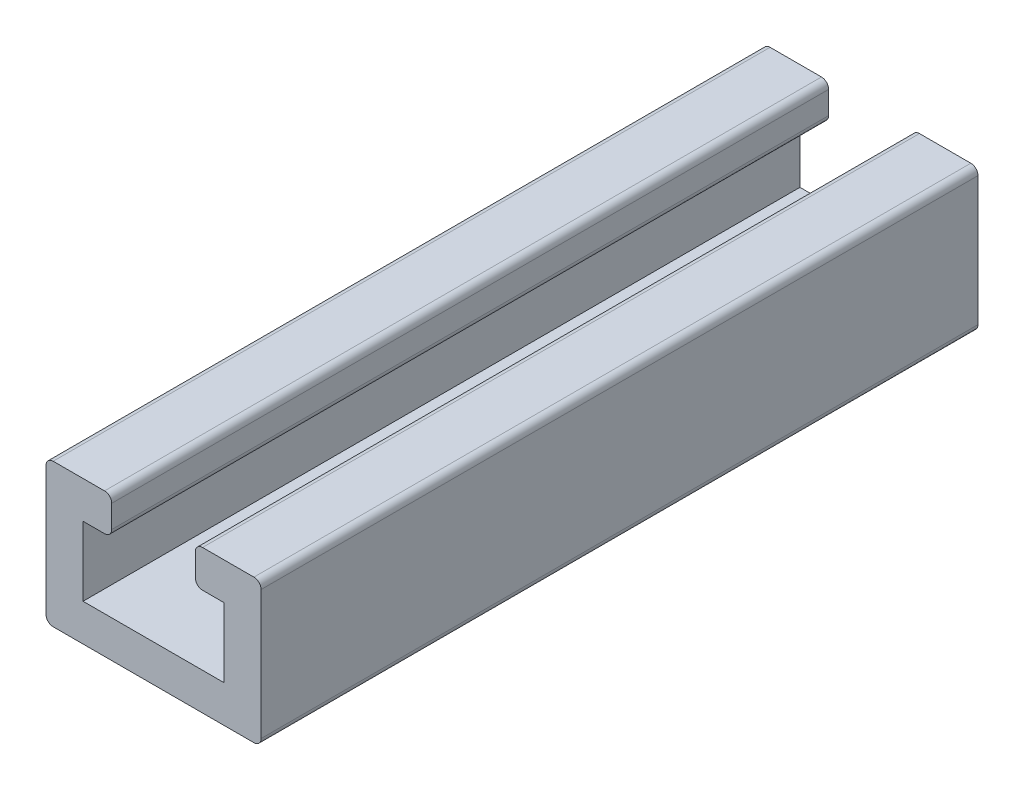
ISO-10303-21;
HEADER;
FILE_DESCRIPTION(('STEP AP214'),'2;1');
FILE_NAME('part.step','',(''),(''),'','','');
FILE_SCHEMA(('AUTOMOTIVE_DESIGN { 1 0 10303 214 1 1 1 1 }'));
ENDSEC;
DATA;
#1=APPLICATION_CONTEXT('core data for automotive mechanical design processes');
#2=APPLICATION_PROTOCOL_DEFINITION('international standard','automotive_design',2000,#1);
#3=PRODUCT_CONTEXT('',#1,'mechanical');
#4=PRODUCT('Part','Part','',(#3));
#5=PRODUCT_RELATED_PRODUCT_CATEGORY('part','',(#4));
#6=PRODUCT_DEFINITION_FORMATION('','',#4);
#7=PRODUCT_DEFINITION_CONTEXT('part definition',#1,'design');
#8=PRODUCT_DEFINITION('design','',#6,#7);
#9=PRODUCT_DEFINITION_SHAPE('','',#8);
#10=(LENGTH_UNIT() NAMED_UNIT(*) SI_UNIT(.MILLI.,.METRE.));
#11=(NAMED_UNIT(*) PLANE_ANGLE_UNIT() SI_UNIT($,.RADIAN.));
#12=(NAMED_UNIT(*) SI_UNIT($,.STERADIAN.) SOLID_ANGLE_UNIT());
#13=UNCERTAINTY_MEASURE_WITH_UNIT(LENGTH_MEASURE(1.E-05),#10,'distance_accuracy_value','');
#14=(GEOMETRIC_REPRESENTATION_CONTEXT(3) GLOBAL_UNCERTAINTY_ASSIGNED_CONTEXT((#13)) GLOBAL_UNIT_ASSIGNED_CONTEXT((#10,
#11,#12)) REPRESENTATION_CONTEXT('',''));
#15=CARTESIAN_POINT('',(0.,0.,0.));
#16=DIRECTION('',(0.,0.,1.));
#17=DIRECTION('',(1.,0.,0.));
#18=AXIS2_PLACEMENT_3D('',#15,#16,#17);
#19=CARTESIAN_POINT('',(-20.0271048862009,7.98576051779936,30.));
#20=DIRECTION('',(0.,0.,-1.));
#21=DIRECTION('',(-1.,0.,0.));
#22=AXIS2_PLACEMENT_3D('',#19,#20,#21);
#23=CYLINDRICAL_SURFACE('',#22,0.300000000000001);
#24=CARTESIAN_POINT('',(-20.0271048862009,7.98576051779936,0.));
#25=DIRECTION('',(0.,0.,1.));
#26=DIRECTION('',(1.,0.,0.));
#27=AXIS2_PLACEMENT_3D('',#24,#25,#26);
#28=CIRCLE('',#27,0.300000000000001);
#29=CARTESIAN_POINT('',(-20.0271048862009,7.68576051779936,0.));
#30=VERTEX_POINT('',#29);
#31=CARTESIAN_POINT('',(-19.7271048862009,7.98576051779936,0.));
#32=VERTEX_POINT('',#31);
#33=EDGE_CURVE('E204',#30,#32,#28,.T.);
#34=ORIENTED_EDGE('',*,*,#33,.T.);
#35=DIRECTION('',(0.,0.,-1.));
#36=VECTOR('',#35,1.);
#37=CARTESIAN_POINT('',(-19.7271048862009,7.98576051779936,30.));
#38=LINE('',#37,#36);
#39=CARTESIAN_POINT('',(-19.7271048862009,7.98576051779936,30.));
#40=VERTEX_POINT('',#39);
#41=EDGE_CURVE('E11',#40,#32,#38,.T.);
#42=ORIENTED_EDGE('',*,*,#41,.F.);
#43=CARTESIAN_POINT('',(-20.0271048862009,7.98576051779936,30.));
#44=DIRECTION('',(0.,0.,1.));
#45=DIRECTION('',(1.,0.,0.));
#46=AXIS2_PLACEMENT_3D('',#43,#44,#45);
#47=CIRCLE('',#46,0.300000000000001);
#48=CARTESIAN_POINT('',(-20.0271048862009,7.68576051779936,30.));
#49=VERTEX_POINT('',#48);
#50=EDGE_CURVE('E242',#49,#40,#47,.T.);
#51=ORIENTED_EDGE('',*,*,#50,.F.);
#52=DIRECTION('',(0.,0.,-1.));
#53=VECTOR('',#52,1.);
#54=CARTESIAN_POINT('',(-20.0271048862009,7.68576051779936,30.));
#55=LINE('',#54,#53);
#56=EDGE_CURVE('E200',#49,#30,#55,.T.);
#57=ORIENTED_EDGE('',*,*,#56,.T.);
#58=EDGE_LOOP('',(#34,#42,#51,#57));
#59=FACE_BOUND('',#58,.T.);
#60=ADVANCED_FACE('F36',(#59),#23,.T.);
#61=CARTESIAN_POINT('',(-19.7271048862009,7.98576051779936,30.));
#62=DIRECTION('',(-1.,0.,0.));
#63=DIRECTION('',(0.,0.,1.));
#64=AXIS2_PLACEMENT_3D('',#61,#62,#63);
#65=PLANE('',#64);
#66=DIRECTION('',(0.,1.,0.));
#67=VECTOR('',#66,1.);
#68=CARTESIAN_POINT('',(-19.7271048862009,7.98576051779936,0.));
#69=LINE('',#68,#67);
#70=CARTESIAN_POINT('',(-19.7271048862009,13.3857605177994,0.));
#71=VERTEX_POINT('',#70);
#72=EDGE_CURVE('E207',#32,#71,#69,.T.);
#73=ORIENTED_EDGE('',*,*,#72,.T.);
#74=DIRECTION('',(0.,0.,-1.));
#75=VECTOR('',#74,1.);
#76=CARTESIAN_POINT('',(-19.7271048862009,13.3857605177994,30.));
#77=LINE('',#76,#75);
#78=CARTESIAN_POINT('',(-19.7271048862009,13.3857605177994,30.));
#79=VERTEX_POINT('',#78);
#80=EDGE_CURVE('E44',#79,#71,#77,.T.);
#81=ORIENTED_EDGE('',*,*,#80,.F.);
#82=DIRECTION('',(0.,1.,0.));
#83=VECTOR('',#82,1.);
#84=CARTESIAN_POINT('',(-19.7271048862009,7.98576051779936,30.));
#85=LINE('',#84,#83);
#86=EDGE_CURVE('E131',#40,#79,#85,.T.);
#87=ORIENTED_EDGE('',*,*,#86,.F.);
#88=ORIENTED_EDGE('',*,*,#41,.T.);
#89=EDGE_LOOP('',(#73,#81,#87,#88));
#90=FACE_BOUND('',#89,.T.);
#91=ADVANCED_FACE('F360',(#90),#65,.F.);
#92=CARTESIAN_POINT('',(-20.0271048862009,13.3857605177994,30.));
#93=DIRECTION('',(0.,0.,-1.));
#94=DIRECTION('',(-1.,0.,0.));
#95=AXIS2_PLACEMENT_3D('',#92,#93,#94);
#96=CYLINDRICAL_SURFACE('',#95,0.300000000000001);
#97=CARTESIAN_POINT('',(-20.0271048862009,13.3857605177994,0.));
#98=DIRECTION('',(0.,0.,1.));
#99=DIRECTION('',(1.,0.,0.));
#100=AXIS2_PLACEMENT_3D('',#97,#98,#99);
#101=CIRCLE('',#100,0.300000000000001);
#102=CARTESIAN_POINT('',(-20.0271048862009,13.6857605177994,0.));
#103=VERTEX_POINT('',#102);
#104=EDGE_CURVE('E209',#71,#103,#101,.T.);
#105=ORIENTED_EDGE('',*,*,#104,.T.);
#106=DIRECTION('',(0.,0.,-1.));
#107=VECTOR('',#106,1.);
#108=CARTESIAN_POINT('',(-20.0271048862009,13.6857605177994,30.));
#109=LINE('',#108,#107);
#110=CARTESIAN_POINT('',(-20.0271048862009,13.6857605177994,30.));
#111=VERTEX_POINT('',#110);
#112=EDGE_CURVE('E285',#111,#103,#109,.T.);
#113=ORIENTED_EDGE('',*,*,#112,.F.);
#114=CARTESIAN_POINT('',(-20.0271048862009,13.3857605177994,30.));
#115=DIRECTION('',(0.,0.,1.));
#116=DIRECTION('',(1.,0.,0.));
#117=AXIS2_PLACEMENT_3D('',#114,#115,#116);
#118=CIRCLE('',#117,0.300000000000001);
#119=EDGE_CURVE('E293',#79,#111,#118,.T.);
#120=ORIENTED_EDGE('',*,*,#119,.F.);
#121=ORIENTED_EDGE('',*,*,#80,.T.);
#122=EDGE_LOOP('',(#105,#113,#120,#121));
#123=FACE_BOUND('',#122,.T.);
#124=ADVANCED_FACE('F291',(#123),#96,.T.);
#125=CARTESIAN_POINT('',(-20.0271048862009,13.6857605177994,30.));
#126=DIRECTION('',(0.,-1.,0.));
#127=DIRECTION('',(0.,0.,-1.));
#128=AXIS2_PLACEMENT_3D('',#125,#126,#127);
#129=PLANE('',#128);
#130=DIRECTION('',(-1.,0.,0.));
#131=VECTOR('',#130,1.);
#132=CARTESIAN_POINT('',(-20.0271048862009,13.6857605177994,0.));
#133=LINE('',#132,#131);
#134=CARTESIAN_POINT('',(-22.1771048862009,13.6857605177994,0.));
#135=VERTEX_POINT('',#134);
#136=EDGE_CURVE('E211',#103,#135,#133,.T.);
#137=ORIENTED_EDGE('',*,*,#136,.T.);
#138=DIRECTION('',(0.,0.,-1.));
#139=VECTOR('',#138,1.);
#140=CARTESIAN_POINT('',(-22.1771048862009,13.6857605177994,30.));
#141=LINE('',#140,#139);
#142=CARTESIAN_POINT('',(-22.1771048862009,13.6857605177994,30.));
#143=VERTEX_POINT('',#142);
#144=EDGE_CURVE('E282',#143,#135,#141,.T.);
#145=ORIENTED_EDGE('',*,*,#144,.F.);
#146=DIRECTION('',(-1.,0.,0.));
#147=VECTOR('',#146,1.);
#148=CARTESIAN_POINT('',(-20.0271048862009,13.6857605177994,30.));
#149=LINE('',#148,#147);
#150=EDGE_CURVE('E311',#111,#143,#149,.T.);
#151=ORIENTED_EDGE('',*,*,#150,.F.);
#152=ORIENTED_EDGE('',*,*,#112,.T.);
#153=EDGE_LOOP('',(#137,#145,#151,#152));
#154=FACE_BOUND('',#153,.T.);
#155=ADVANCED_FACE('F302',(#154),#129,.F.);
#156=CARTESIAN_POINT('',(-22.1771048862009,13.3857605177994,30.));
#157=DIRECTION('',(0.,0.,-1.));
#158=DIRECTION('',(-1.,0.,0.));
#159=AXIS2_PLACEMENT_3D('',#156,#157,#158);
#160=CYLINDRICAL_SURFACE('',#159,0.300000000000001);
#161=CARTESIAN_POINT('',(-22.1771048862009,13.3857605177994,0.));
#162=DIRECTION('',(0.,0.,1.));
#163=DIRECTION('',(1.,0.,0.));
#164=AXIS2_PLACEMENT_3D('',#161,#162,#163);
#165=CIRCLE('',#164,0.300000000000001);
#166=CARTESIAN_POINT('',(-22.4771048862009,13.3857605177994,0.));
#167=VERTEX_POINT('',#166);
#168=EDGE_CURVE('E213',#135,#167,#165,.T.);
#169=ORIENTED_EDGE('',*,*,#168,.T.);
#170=DIRECTION('',(0.,0.,-1.));
#171=VECTOR('',#170,1.);
#172=CARTESIAN_POINT('',(-22.4771048862009,13.3857605177994,30.));
#173=LINE('',#172,#171);
#174=CARTESIAN_POINT('',(-22.4771048862009,13.3857605177994,30.));
#175=VERTEX_POINT('',#174);
#176=EDGE_CURVE('E279',#175,#167,#173,.T.);
#177=ORIENTED_EDGE('',*,*,#176,.F.);
#178=CARTESIAN_POINT('',(-22.1771048862009,13.3857605177994,30.));
#179=DIRECTION('',(0.,0.,1.));
#180=DIRECTION('',(1.,0.,0.));
#181=AXIS2_PLACEMENT_3D('',#178,#179,#180);
#182=CIRCLE('',#181,0.300000000000001);
#183=EDGE_CURVE('E308',#143,#175,#182,.T.);
#184=ORIENTED_EDGE('',*,*,#183,.F.);
#185=ORIENTED_EDGE('',*,*,#144,.T.);
#186=EDGE_LOOP('',(#169,#177,#184,#185));
#187=FACE_BOUND('',#186,.T.);
#188=ADVANCED_FACE('F306',(#187),#160,.T.);
#189=CARTESIAN_POINT('',(-22.4771048862009,13.3857605177994,30.));
#190=DIRECTION('',(1.,0.,0.));
#191=DIRECTION('',(0.,0.,-1.));
#192=AXIS2_PLACEMENT_3D('',#189,#190,#191);
#193=PLANE('',#192);
#194=DIRECTION('',(0.,-1.,0.));
#195=VECTOR('',#194,1.);
#196=CARTESIAN_POINT('',(-22.4771048862009,13.3857605177994,0.));
#197=LINE('',#196,#195);
#198=CARTESIAN_POINT('',(-22.4771048862009,12.4357605177994,0.));
#199=VERTEX_POINT('',#198);
#200=EDGE_CURVE('E215',#167,#199,#197,.T.);
#201=ORIENTED_EDGE('',*,*,#200,.T.);
#202=DIRECTION('',(0.,0.,-1.));
#203=VECTOR('',#202,1.);
#204=CARTESIAN_POINT('',(-22.4771048862009,12.4357605177994,30.));
#205=LINE('',#204,#203);
#206=CARTESIAN_POINT('',(-22.4771048862009,12.4357605177994,30.));
#207=VERTEX_POINT('',#206);
#208=EDGE_CURVE('E276',#207,#199,#205,.T.);
#209=ORIENTED_EDGE('',*,*,#208,.F.);
#210=DIRECTION('',(0.,-1.,0.));
#211=VECTOR('',#210,1.);
#212=CARTESIAN_POINT('',(-22.4771048862009,13.3857605177994,30.));
#213=LINE('',#212,#211);
#214=EDGE_CURVE('E310',#175,#207,#213,.T.);
#215=ORIENTED_EDGE('',*,*,#214,.F.);
#216=ORIENTED_EDGE('',*,*,#176,.T.);
#217=EDGE_LOOP('',(#201,#209,#215,#216));
#218=FACE_BOUND('',#217,.T.);
#219=ADVANCED_FACE('F373',(#218),#193,.F.);
#220=CARTESIAN_POINT('',(-22.1771048862009,12.4357605177994,30.));
#221=DIRECTION('',(0.,0.,-1.));
#222=DIRECTION('',(-1.,0.,0.));
#223=AXIS2_PLACEMENT_3D('',#220,#221,#222);
#224=CYLINDRICAL_SURFACE('',#223,0.300000000000001);
#225=CARTESIAN_POINT('',(-22.1771048862009,12.4357605177994,0.));
#226=DIRECTION('',(0.,0.,1.));
#227=DIRECTION('',(-1.,0.,0.));
#228=AXIS2_PLACEMENT_3D('',#225,#226,#227);
#229=CIRCLE('',#228,0.300000000000001);
#230=CARTESIAN_POINT('',(-22.1771048862009,12.1357605177994,0.));
#231=VERTEX_POINT('',#230);
#232=EDGE_CURVE('E217',#199,#231,#229,.T.);
#233=ORIENTED_EDGE('',*,*,#232,.T.);
#234=DIRECTION('',(0.,0.,-1.));
#235=VECTOR('',#234,1.);
#236=CARTESIAN_POINT('',(-22.1771048862009,12.1357605177994,30.));
#237=LINE('',#236,#235);
#238=CARTESIAN_POINT('',(-22.1771048862009,12.1357605177994,30.));
#239=VERTEX_POINT('',#238);
#240=EDGE_CURVE('E273',#239,#231,#237,.T.);
#241=ORIENTED_EDGE('',*,*,#240,.F.);
#242=CARTESIAN_POINT('',(-22.1771048862009,12.4357605177994,30.));
#243=DIRECTION('',(0.,0.,1.));
#244=DIRECTION('',(-1.,0.,0.));
#245=AXIS2_PLACEMENT_3D('',#242,#243,#244);
#246=CIRCLE('',#245,0.300000000000001);
#247=EDGE_CURVE('E313',#207,#239,#246,.T.);
#248=ORIENTED_EDGE('',*,*,#247,.F.);
#249=ORIENTED_EDGE('',*,*,#208,.T.);
#250=EDGE_LOOP('',(#233,#241,#248,#249));
#251=FACE_BOUND('',#250,.T.);
#252=ADVANCED_FACE('F376',(#251),#224,.T.);
#253=CARTESIAN_POINT('',(-22.1771048862009,12.1357605177994,30.));
#254=DIRECTION('',(0.,1.,0.));
#255=DIRECTION('',(0.,0.,1.));
#256=AXIS2_PLACEMENT_3D('',#253,#254,#255);
#257=PLANE('',#256);
#258=DIRECTION('',(1.,0.,0.));
#259=VECTOR('',#258,1.);
#260=CARTESIAN_POINT('',(-22.1771048862009,12.1357605177994,0.));
#261=LINE('',#260,#259);
#262=CARTESIAN_POINT('',(-21.2771048862009,12.1357605177994,0.));
#263=VERTEX_POINT('',#262);
#264=EDGE_CURVE('E219',#231,#263,#261,.T.);
#265=ORIENTED_EDGE('',*,*,#264,.T.);
#266=DIRECTION('',(0.,0.,-1.));
#267=VECTOR('',#266,1.);
#268=CARTESIAN_POINT('',(-21.2771048862009,12.1357605177994,30.));
#269=LINE('',#268,#267);
#270=CARTESIAN_POINT('',(-21.2771048862009,12.1357605177994,30.));
#271=VERTEX_POINT('',#270);
#272=EDGE_CURVE('E270',#271,#263,#269,.T.);
#273=ORIENTED_EDGE('',*,*,#272,.F.);
#274=DIRECTION('',(1.,0.,0.));
#275=VECTOR('',#274,1.);
#276=CARTESIAN_POINT('',(-22.1771048862009,12.1357605177994,30.));
#277=LINE('',#276,#275);
#278=EDGE_CURVE('E319',#239,#271,#277,.T.);
#279=ORIENTED_EDGE('',*,*,#278,.F.);
#280=ORIENTED_EDGE('',*,*,#240,.T.);
#281=EDGE_LOOP('',(#265,#273,#279,#280));
#282=FACE_BOUND('',#281,.T.);
#283=ADVANCED_FACE('F380',(#282),#257,.F.);
#284=CARTESIAN_POINT('',(-21.2771048862009,12.1357605177994,30.));
#285=DIRECTION('',(1.,0.,0.));
#286=DIRECTION('',(0.,0.,-1.));
#287=AXIS2_PLACEMENT_3D('',#284,#285,#286);
#288=PLANE('',#287);
#289=DIRECTION('',(0.,-1.,0.));
#290=VECTOR('',#289,1.);
#291=CARTESIAN_POINT('',(-21.2771048862009,12.1357605177994,0.));
#292=LINE('',#291,#290);
#293=CARTESIAN_POINT('',(-21.2771048862009,9.23576051779936,0.));
#294=VERTEX_POINT('',#293);
#295=EDGE_CURVE('E221',#263,#294,#292,.T.);
#296=ORIENTED_EDGE('',*,*,#295,.T.);
#297=DIRECTION('',(0.,0.,-1.));
#298=VECTOR('',#297,1.);
#299=CARTESIAN_POINT('',(-21.2771048862009,9.23576051779936,30.));
#300=LINE('',#299,#298);
#301=CARTESIAN_POINT('',(-21.2771048862009,9.23576051779936,30.));
#302=VERTEX_POINT('',#301);
#303=EDGE_CURVE('E267',#302,#294,#300,.T.);
#304=ORIENTED_EDGE('',*,*,#303,.F.);
#305=DIRECTION('',(0.,-1.,0.));
#306=VECTOR('',#305,1.);
#307=CARTESIAN_POINT('',(-21.2771048862009,12.1357605177994,30.));
#308=LINE('',#307,#306);
#309=EDGE_CURVE('E321',#271,#302,#308,.T.);
#310=ORIENTED_EDGE('',*,*,#309,.F.);
#311=ORIENTED_EDGE('',*,*,#272,.T.);
#312=EDGE_LOOP('',(#296,#304,#310,#311));
#313=FACE_BOUND('',#312,.T.);
#314=ADVANCED_FACE('F384',(#313),#288,.F.);
#315=CARTESIAN_POINT('',(-21.2771048862009,9.23576051779936,30.));
#316=DIRECTION('',(0.,-1.,0.));
#317=DIRECTION('',(1.,0.,0.));
#318=AXIS2_PLACEMENT_3D('',#315,#316,#317);
#319=PLANE('',#318);
#320=DIRECTION('',(-1.,0.,0.));
#321=VECTOR('',#320,1.);
#322=CARTESIAN_POINT('',(-21.2771048862009,9.23576051779936,0.));
#323=LINE('',#322,#321);
#324=CARTESIAN_POINT('',(-27.1771048862009,9.23576051779936,0.));
#325=VERTEX_POINT('',#324);
#326=EDGE_CURVE('E223',#294,#325,#323,.T.);
#327=ORIENTED_EDGE('',*,*,#326,.T.);
#328=DIRECTION('',(0.,0.,-1.));
#329=VECTOR('',#328,1.);
#330=CARTESIAN_POINT('',(-27.1771048862009,9.23576051779936,30.));
#331=LINE('',#330,#329);
#332=CARTESIAN_POINT('',(-27.1771048862009,9.23576051779936,30.));
#333=VERTEX_POINT('',#332);
#334=EDGE_CURVE('E264',#333,#325,#331,.T.);
#335=ORIENTED_EDGE('',*,*,#334,.F.);
#336=DIRECTION('',(-1.,0.,0.));
#337=VECTOR('',#336,1.);
#338=CARTESIAN_POINT('',(-21.2771048862009,9.23576051779936,30.));
#339=LINE('',#338,#337);
#340=EDGE_CURVE('E323',#302,#333,#339,.T.);
#341=ORIENTED_EDGE('',*,*,#340,.F.);
#342=ORIENTED_EDGE('',*,*,#303,.T.);
#343=EDGE_LOOP('',(#327,#335,#341,#342));
#344=FACE_BOUND('',#343,.T.);
#345=ADVANCED_FACE('F388',(#344),#319,.F.);
#346=CARTESIAN_POINT('',(-27.1771048862009,12.1357605177994,30.));
#347=DIRECTION('',(-1.,0.,0.));
#348=DIRECTION('',(0.,0.,1.));
#349=AXIS2_PLACEMENT_3D('',#346,#347,#348);
#350=PLANE('',#349);
#351=DIRECTION('',(0.,1.,0.));
#352=VECTOR('',#351,1.);
#353=CARTESIAN_POINT('',(-27.1771048862009,12.1357605177994,0.));
#354=LINE('',#353,#352);
#355=CARTESIAN_POINT('',(-27.1771048862009,12.1357605177994,0.));
#356=VERTEX_POINT('',#355);
#357=EDGE_CURVE('E225',#325,#356,#354,.T.);
#358=ORIENTED_EDGE('',*,*,#357,.T.);
#359=DIRECTION('',(0.,0.,-1.));
#360=VECTOR('',#359,1.);
#361=CARTESIAN_POINT('',(-27.1771048862009,12.1357605177994,30.));
#362=LINE('',#361,#360);
#363=CARTESIAN_POINT('',(-27.1771048862009,12.1357605177994,30.));
#364=VERTEX_POINT('',#363);
#365=EDGE_CURVE('E261',#364,#356,#362,.T.);
#366=ORIENTED_EDGE('',*,*,#365,.F.);
#367=DIRECTION('',(0.,1.,0.));
#368=VECTOR('',#367,1.);
#369=CARTESIAN_POINT('',(-27.1771048862009,12.1357605177994,30.));
#370=LINE('',#369,#368);
#371=EDGE_CURVE('E325',#333,#364,#370,.T.);
#372=ORIENTED_EDGE('',*,*,#371,.F.);
#373=ORIENTED_EDGE('',*,*,#334,.T.);
#374=EDGE_LOOP('',(#358,#366,#372,#373));
#375=FACE_BOUND('',#374,.T.);
#376=ADVANCED_FACE('F392',(#375),#350,.F.);
#377=CARTESIAN_POINT('',(-26.2771048862009,12.1357605177994,30.));
#378=DIRECTION('',(0.,1.,0.));
#379=DIRECTION('',(0.,0.,1.));
#380=AXIS2_PLACEMENT_3D('',#377,#378,#379);
#381=PLANE('',#380);
#382=DIRECTION('',(1.,0.,0.));
#383=VECTOR('',#382,1.);
#384=CARTESIAN_POINT('',(-26.2771048862009,12.1357605177994,0.));
#385=LINE('',#384,#383);
#386=CARTESIAN_POINT('',(-26.2771048862009,12.1357605177994,0.));
#387=VERTEX_POINT('',#386);
#388=EDGE_CURVE('E227',#356,#387,#385,.T.);
#389=ORIENTED_EDGE('',*,*,#388,.T.);
#390=DIRECTION('',(0.,0.,-1.));
#391=VECTOR('',#390,1.);
#392=CARTESIAN_POINT('',(-26.2771048862009,12.1357605177994,30.));
#393=LINE('',#392,#391);
#394=CARTESIAN_POINT('',(-26.2771048862009,12.1357605177994,30.));
#395=VERTEX_POINT('',#394);
#396=EDGE_CURVE('E258',#395,#387,#393,.T.);
#397=ORIENTED_EDGE('',*,*,#396,.F.);
#398=DIRECTION('',(1.,0.,0.));
#399=VECTOR('',#398,1.);
#400=CARTESIAN_POINT('',(-26.2771048862009,12.1357605177994,30.));
#401=LINE('',#400,#399);
#402=EDGE_CURVE('E327',#364,#395,#401,.T.);
#403=ORIENTED_EDGE('',*,*,#402,.F.);
#404=ORIENTED_EDGE('',*,*,#365,.T.);
#405=EDGE_LOOP('',(#389,#397,#403,#404));
#406=FACE_BOUND('',#405,.T.);
#407=ADVANCED_FACE('F396',(#406),#381,.F.);
#408=CARTESIAN_POINT('',(-26.2771048862009,12.4357605177994,30.));
#409=DIRECTION('',(0.,0.,-1.));
#410=DIRECTION('',(-1.,0.,0.));
#411=AXIS2_PLACEMENT_3D('',#408,#409,#410);
#412=CYLINDRICAL_SURFACE('',#411,0.300000000000001);
#413=CARTESIAN_POINT('',(-26.2771048862009,12.4357605177994,0.));
#414=DIRECTION('',(0.,0.,1.));
#415=DIRECTION('',(1.,0.,0.));
#416=AXIS2_PLACEMENT_3D('',#413,#414,#415);
#417=CIRCLE('',#416,0.300000000000001);
#418=CARTESIAN_POINT('',(-25.9771048862009,12.4357605177994,0.));
#419=VERTEX_POINT('',#418);
#420=EDGE_CURVE('E229',#387,#419,#417,.T.);
#421=ORIENTED_EDGE('',*,*,#420,.T.);
#422=DIRECTION('',(0.,0.,-1.));
#423=VECTOR('',#422,1.);
#424=CARTESIAN_POINT('',(-25.9771048862009,12.4357605177994,30.));
#425=LINE('',#424,#423);
#426=CARTESIAN_POINT('',(-25.9771048862009,12.4357605177994,30.));
#427=VERTEX_POINT('',#426);
#428=EDGE_CURVE('E255',#427,#419,#425,.T.);
#429=ORIENTED_EDGE('',*,*,#428,.F.);
#430=CARTESIAN_POINT('',(-26.2771048862009,12.4357605177994,30.));
#431=DIRECTION('',(0.,0.,1.));
#432=DIRECTION('',(1.,0.,0.));
#433=AXIS2_PLACEMENT_3D('',#430,#431,#432);
#434=CIRCLE('',#433,0.300000000000001);
#435=EDGE_CURVE('E329',#395,#427,#434,.T.);
#436=ORIENTED_EDGE('',*,*,#435,.F.);
#437=ORIENTED_EDGE('',*,*,#396,.T.);
#438=EDGE_LOOP('',(#421,#429,#436,#437));
#439=FACE_BOUND('',#438,.T.);
#440=ADVANCED_FACE('F400',(#439),#412,.T.);
#441=CARTESIAN_POINT('',(-25.9771048862009,13.3857605177994,30.));
#442=DIRECTION('',(-1.,0.,0.));
#443=DIRECTION('',(0.,0.,1.));
#444=AXIS2_PLACEMENT_3D('',#441,#442,#443);
#445=PLANE('',#444);
#446=DIRECTION('',(0.,1.,0.));
#447=VECTOR('',#446,1.);
#448=CARTESIAN_POINT('',(-25.9771048862009,13.3857605177994,0.));
#449=LINE('',#448,#447);
#450=CARTESIAN_POINT('',(-25.9771048862009,13.3857605177994,0.));
#451=VERTEX_POINT('',#450);
#452=EDGE_CURVE('E231',#419,#451,#449,.T.);
#453=ORIENTED_EDGE('',*,*,#452,.T.);
#454=DIRECTION('',(0.,0.,-1.));
#455=VECTOR('',#454,1.);
#456=CARTESIAN_POINT('',(-25.9771048862009,13.3857605177994,30.));
#457=LINE('',#456,#455);
#458=CARTESIAN_POINT('',(-25.9771048862009,13.3857605177994,30.));
#459=VERTEX_POINT('',#458);
#460=EDGE_CURVE('E252',#459,#451,#457,.T.);
#461=ORIENTED_EDGE('',*,*,#460,.F.);
#462=DIRECTION('',(0.,1.,0.));
#463=VECTOR('',#462,1.);
#464=CARTESIAN_POINT('',(-25.9771048862009,13.3857605177994,30.));
#465=LINE('',#464,#463);
#466=EDGE_CURVE('E331',#427,#459,#465,.T.);
#467=ORIENTED_EDGE('',*,*,#466,.F.);
#468=ORIENTED_EDGE('',*,*,#428,.T.);
#469=EDGE_LOOP('',(#453,#461,#467,#468));
#470=FACE_BOUND('',#469,.T.);
#471=ADVANCED_FACE('F404',(#470),#445,.F.);
#472=CARTESIAN_POINT('',(-26.2771048862009,13.3857605177994,30.));
#473=DIRECTION('',(0.,0.,-1.));
#474=DIRECTION('',(-1.,0.,0.));
#475=AXIS2_PLACEMENT_3D('',#472,#473,#474);
#476=CYLINDRICAL_SURFACE('',#475,0.300000000000001);
#477=CARTESIAN_POINT('',(-26.2771048862009,13.3857605177994,0.));
#478=DIRECTION('',(0.,0.,1.));
#479=DIRECTION('',(-1.,0.,0.));
#480=AXIS2_PLACEMENT_3D('',#477,#478,#479);
#481=CIRCLE('',#480,0.300000000000001);
#482=CARTESIAN_POINT('',(-26.2771048862009,13.6857605177994,0.));
#483=VERTEX_POINT('',#482);
#484=EDGE_CURVE('E233',#451,#483,#481,.T.);
#485=ORIENTED_EDGE('',*,*,#484,.T.);
#486=DIRECTION('',(0.,0.,-1.));
#487=VECTOR('',#486,1.);
#488=CARTESIAN_POINT('',(-26.2771048862009,13.6857605177994,30.));
#489=LINE('',#488,#487);
#490=CARTESIAN_POINT('',(-26.2771048862009,13.6857605177994,30.));
#491=VERTEX_POINT('',#490);
#492=EDGE_CURVE('E249',#491,#483,#489,.T.);
#493=ORIENTED_EDGE('',*,*,#492,.F.);
#494=CARTESIAN_POINT('',(-26.2771048862009,13.3857605177994,30.));
#495=DIRECTION('',(0.,0.,1.));
#496=DIRECTION('',(-1.,0.,0.));
#497=AXIS2_PLACEMENT_3D('',#494,#495,#496);
#498=CIRCLE('',#497,0.300000000000001);
#499=EDGE_CURVE('E333',#459,#491,#498,.T.);
#500=ORIENTED_EDGE('',*,*,#499,.F.);
#501=ORIENTED_EDGE('',*,*,#460,.T.);
#502=EDGE_LOOP('',(#485,#493,#500,#501));
#503=FACE_BOUND('',#502,.T.);
#504=ADVANCED_FACE('F408',(#503),#476,.T.);
#505=CARTESIAN_POINT('',(-28.4271048862009,13.6857605177994,30.));
#506=DIRECTION('',(0.,-1.,0.));
#507=DIRECTION('',(0.,0.,-1.));
#508=AXIS2_PLACEMENT_3D('',#505,#506,#507);
#509=PLANE('',#508);
#510=DIRECTION('',(-1.,0.,0.));
#511=VECTOR('',#510,1.);
#512=CARTESIAN_POINT('',(-28.4271048862009,13.6857605177994,0.));
#513=LINE('',#512,#511);
#514=CARTESIAN_POINT('',(-28.4271048862009,13.6857605177994,0.));
#515=VERTEX_POINT('',#514);
#516=EDGE_CURVE('E235',#483,#515,#513,.T.);
#517=ORIENTED_EDGE('',*,*,#516,.T.);
#518=DIRECTION('',(0.,0.,-1.));
#519=VECTOR('',#518,1.);
#520=CARTESIAN_POINT('',(-28.4271048862009,13.6857605177994,30.));
#521=LINE('',#520,#519);
#522=CARTESIAN_POINT('',(-28.4271048862009,13.6857605177994,30.));
#523=VERTEX_POINT('',#522);
#524=EDGE_CURVE('E246',#523,#515,#521,.T.);
#525=ORIENTED_EDGE('',*,*,#524,.F.);
#526=DIRECTION('',(-1.,0.,0.));
#527=VECTOR('',#526,1.);
#528=CARTESIAN_POINT('',(-28.4271048862009,13.6857605177994,30.));
#529=LINE('',#528,#527);
#530=EDGE_CURVE('E335',#491,#523,#529,.T.);
#531=ORIENTED_EDGE('',*,*,#530,.F.);
#532=ORIENTED_EDGE('',*,*,#492,.T.);
#533=EDGE_LOOP('',(#517,#525,#531,#532));
#534=FACE_BOUND('',#533,.T.);
#535=ADVANCED_FACE('F341',(#534),#509,.F.);
#536=CARTESIAN_POINT('',(-28.4271048862009,13.3857605177994,30.));
#537=DIRECTION('',(0.,0.,-1.));
#538=DIRECTION('',(-1.,0.,0.));
#539=AXIS2_PLACEMENT_3D('',#536,#537,#538);
#540=CYLINDRICAL_SURFACE('',#539,0.300000000000001);
#541=CARTESIAN_POINT('',(-28.4271048862009,13.3857605177994,0.));
#542=DIRECTION('',(0.,0.,1.));
#543=DIRECTION('',(-1.,0.,0.));
#544=AXIS2_PLACEMENT_3D('',#541,#542,#543);
#545=CIRCLE('',#544,0.300000000000001);
#546=CARTESIAN_POINT('',(-28.7271048862009,13.3857605177994,0.));
#547=VERTEX_POINT('',#546);
#548=EDGE_CURVE('E237',#515,#547,#545,.T.);
#549=ORIENTED_EDGE('',*,*,#548,.T.);
#550=DIRECTION('',(0.,0.,-1.));
#551=VECTOR('',#550,1.);
#552=CARTESIAN_POINT('',(-28.7271048862009,13.3857605177994,30.));
#553=LINE('',#552,#551);
#554=CARTESIAN_POINT('',(-28.7271048862009,13.3857605177994,30.));
#555=VERTEX_POINT('',#554);
#556=EDGE_CURVE('E195',#555,#547,#553,.T.);
#557=ORIENTED_EDGE('',*,*,#556,.F.);
#558=CARTESIAN_POINT('',(-28.4271048862009,13.3857605177994,30.));
#559=DIRECTION('',(0.,0.,1.));
#560=DIRECTION('',(-1.,0.,0.));
#561=AXIS2_PLACEMENT_3D('',#558,#559,#560);
#562=CIRCLE('',#561,0.300000000000001);
#563=EDGE_CURVE('E186',#523,#555,#562,.T.);
#564=ORIENTED_EDGE('',*,*,#563,.F.);
#565=ORIENTED_EDGE('',*,*,#524,.T.);
#566=EDGE_LOOP('',(#549,#557,#564,#565));
#567=FACE_BOUND('',#566,.T.);
#568=ADVANCED_FACE('F345',(#567),#540,.T.);
#569=CARTESIAN_POINT('',(-28.7271048862009,7.98576051779936,30.));
#570=DIRECTION('',(1.,0.,0.));
#571=DIRECTION('',(0.,0.,-1.));
#572=AXIS2_PLACEMENT_3D('',#569,#570,#571);
#573=PLANE('',#572);
#574=DIRECTION('',(0.,-1.,0.));
#575=VECTOR('',#574,1.);
#576=CARTESIAN_POINT('',(-28.7271048862009,7.98576051779936,0.));
#577=LINE('',#576,#575);
#578=CARTESIAN_POINT('',(-28.7271048862009,7.98576051779936,0.));
#579=VERTEX_POINT('',#578);
#580=EDGE_CURVE('E194',#547,#579,#577,.T.);
#581=ORIENTED_EDGE('',*,*,#580,.T.);
#582=DIRECTION('',(0.,0.,-1.));
#583=VECTOR('',#582,1.);
#584=CARTESIAN_POINT('',(-28.7271048862009,7.98576051779936,30.));
#585=LINE('',#584,#583);
#586=CARTESIAN_POINT('',(-28.7271048862009,7.98576051779936,30.));
#587=VERTEX_POINT('',#586);
#588=EDGE_CURVE('E191',#587,#579,#585,.T.);
#589=ORIENTED_EDGE('',*,*,#588,.F.);
#590=DIRECTION('',(0.,-1.,0.));
#591=VECTOR('',#590,1.);
#592=CARTESIAN_POINT('',(-28.7271048862009,7.98576051779936,30.));
#593=LINE('',#592,#591);
#594=EDGE_CURVE('E180',#555,#587,#593,.T.);
#595=ORIENTED_EDGE('',*,*,#594,.F.);
#596=ORIENTED_EDGE('',*,*,#556,.T.);
#597=EDGE_LOOP('',(#581,#589,#595,#596));
#598=FACE_BOUND('',#597,.T.);
#599=ADVANCED_FACE('F192',(#598),#573,.F.);
#600=CARTESIAN_POINT('',(-28.4271048862009,7.98576051779936,30.));
#601=DIRECTION('',(0.,0.,-1.));
#602=DIRECTION('',(-1.,0.,0.));
#603=AXIS2_PLACEMENT_3D('',#600,#601,#602);
#604=CYLINDRICAL_SURFACE('',#603,0.300000000000001);
#605=CARTESIAN_POINT('',(-28.4271048862009,7.98576051779936,0.));
#606=DIRECTION('',(0.,0.,1.));
#607=DIRECTION('',(-1.,0.,0.));
#608=AXIS2_PLACEMENT_3D('',#605,#606,#607);
#609=CIRCLE('',#608,0.300000000000001);
#610=CARTESIAN_POINT('',(-28.4271048862009,7.68576051779936,0.));
#611=VERTEX_POINT('',#610);
#612=EDGE_CURVE('E117',#579,#611,#609,.T.);
#613=ORIENTED_EDGE('',*,*,#612,.T.);
#614=DIRECTION('',(0.,0.,-1.));
#615=VECTOR('',#614,1.);
#616=CARTESIAN_POINT('',(-28.4271048862009,7.68576051779936,30.));
#617=LINE('',#616,#615);
#618=CARTESIAN_POINT('',(-28.4271048862009,7.68576051779936,30.));
#619=VERTEX_POINT('',#618);
#620=EDGE_CURVE('E196',#619,#611,#617,.T.);
#621=ORIENTED_EDGE('',*,*,#620,.F.);
#622=CARTESIAN_POINT('',(-28.4271048862009,7.98576051779936,30.));
#623=DIRECTION('',(0.,0.,1.));
#624=DIRECTION('',(-1.,0.,0.));
#625=AXIS2_PLACEMENT_3D('',#622,#623,#624);
#626=CIRCLE('',#625,0.300000000000001);
#627=EDGE_CURVE('E184',#587,#619,#626,.T.);
#628=ORIENTED_EDGE('',*,*,#627,.F.);
#629=ORIENTED_EDGE('',*,*,#588,.T.);
#630=EDGE_LOOP('',(#613,#621,#628,#629));
#631=FACE_BOUND('',#630,.T.);
#632=ADVANCED_FACE('F198',(#631),#604,.T.);
#633=CARTESIAN_POINT('',(-28.4271048862009,7.68576051779936,30.));
#634=DIRECTION('',(0.,1.,0.));
#635=DIRECTION('',(0.,0.,1.));
#636=AXIS2_PLACEMENT_3D('',#633,#634,#635);
#637=PLANE('',#636);
#638=DIRECTION('',(1.,0.,0.));
#639=VECTOR('',#638,1.);
#640=CARTESIAN_POINT('',(-28.4271048862009,7.68576051779936,0.));
#641=LINE('',#640,#639);
#642=EDGE_CURVE('E123',#611,#30,#641,.T.);
#643=ORIENTED_EDGE('',*,*,#642,.T.);
#644=ORIENTED_EDGE('',*,*,#56,.F.);
#645=DIRECTION('',(1.,0.,0.));
#646=VECTOR('',#645,1.);
#647=CARTESIAN_POINT('',(-28.4271048862009,7.68576051779936,30.));
#648=LINE('',#647,#646);
#649=EDGE_CURVE('E52',#619,#49,#648,.T.);
#650=ORIENTED_EDGE('',*,*,#649,.F.);
#651=ORIENTED_EDGE('',*,*,#620,.T.);
#652=EDGE_LOOP('',(#643,#644,#650,#651));
#653=FACE_BOUND('',#652,.T.);
#654=ADVANCED_FACE('F349',(#653),#637,.F.);
#655=CARTESIAN_POINT('',(-20.0271048862009,7.98576051779936,30.));
#656=DIRECTION('',(0.,0.,1.));
#657=DIRECTION('',(1.,0.,0.));
#658=AXIS2_PLACEMENT_3D('',#655,#656,#657);
#659=PLANE('',#658);
#660=ORIENTED_EDGE('',*,*,#50,.T.);
#661=ORIENTED_EDGE('',*,*,#86,.T.);
#662=ORIENTED_EDGE('',*,*,#119,.T.);
#663=ORIENTED_EDGE('',*,*,#150,.T.);
#664=ORIENTED_EDGE('',*,*,#183,.T.);
#665=ORIENTED_EDGE('',*,*,#214,.T.);
#666=ORIENTED_EDGE('',*,*,#247,.T.);
#667=ORIENTED_EDGE('',*,*,#278,.T.);
#668=ORIENTED_EDGE('',*,*,#309,.T.);
#669=ORIENTED_EDGE('',*,*,#340,.T.);
#670=ORIENTED_EDGE('',*,*,#371,.T.);
#671=ORIENTED_EDGE('',*,*,#402,.T.);
#672=ORIENTED_EDGE('',*,*,#435,.T.);
#673=ORIENTED_EDGE('',*,*,#466,.T.);
#674=ORIENTED_EDGE('',*,*,#499,.T.);
#675=ORIENTED_EDGE('',*,*,#530,.T.);
#676=ORIENTED_EDGE('',*,*,#563,.T.);
#677=ORIENTED_EDGE('',*,*,#594,.T.);
#678=ORIENTED_EDGE('',*,*,#627,.T.);
#679=ORIENTED_EDGE('',*,*,#649,.T.);
#680=EDGE_LOOP('',(#660,#661,#662,#663,#664,#665,#666,#667,#668,#669,#670,#671,#672,#673,#674,
#675,#676,#677,#678,#679));
#681=FACE_BOUND('',#680,.T.);
#682=ADVANCED_FACE('F182',(#681),#659,.T.);
#683=CARTESIAN_POINT('',(-20.0271048862009,7.98576051779936,0.));
#684=DIRECTION('',(0.,0.,1.));
#685=DIRECTION('',(1.,0.,0.));
#686=AXIS2_PLACEMENT_3D('',#683,#684,#685);
#687=PLANE('',#686);
#688=ORIENTED_EDGE('',*,*,#33,.F.);
#689=ORIENTED_EDGE('',*,*,#642,.F.);
#690=ORIENTED_EDGE('',*,*,#612,.F.);
#691=ORIENTED_EDGE('',*,*,#580,.F.);
#692=ORIENTED_EDGE('',*,*,#548,.F.);
#693=ORIENTED_EDGE('',*,*,#516,.F.);
#694=ORIENTED_EDGE('',*,*,#484,.F.);
#695=ORIENTED_EDGE('',*,*,#452,.F.);
#696=ORIENTED_EDGE('',*,*,#420,.F.);
#697=ORIENTED_EDGE('',*,*,#388,.F.);
#698=ORIENTED_EDGE('',*,*,#357,.F.);
#699=ORIENTED_EDGE('',*,*,#326,.F.);
#700=ORIENTED_EDGE('',*,*,#295,.F.);
#701=ORIENTED_EDGE('',*,*,#264,.F.);
#702=ORIENTED_EDGE('',*,*,#232,.F.);
#703=ORIENTED_EDGE('',*,*,#200,.F.);
#704=ORIENTED_EDGE('',*,*,#168,.F.);
#705=ORIENTED_EDGE('',*,*,#136,.F.);
#706=ORIENTED_EDGE('',*,*,#104,.F.);
#707=ORIENTED_EDGE('',*,*,#72,.F.);
#708=EDGE_LOOP('',(#688,#689,#690,#691,#692,#693,#694,#695,#696,#697,#698,#699,#700,#701,#702,
#703,#704,#705,#706,#707));
#709=FACE_BOUND('',#708,.T.);
#710=ADVANCED_FACE('F297',(#709),#687,.F.);
#711=CLOSED_SHELL('',(#60,#91,#124,#155,#188,#219,#252,#283,#314,#345,#376,#407,#440,#471,#504,
#535,#568,#599,#632,#654,#682,#710));
#712=MANIFOLD_SOLID_BREP('B2',#711);
#713=ADVANCED_BREP_SHAPE_REPRESENTATION('',(#18,#712),#14);
#714=SHAPE_DEFINITION_REPRESENTATION(#9,#713);
ENDSEC;
END-ISO-10303-21;
